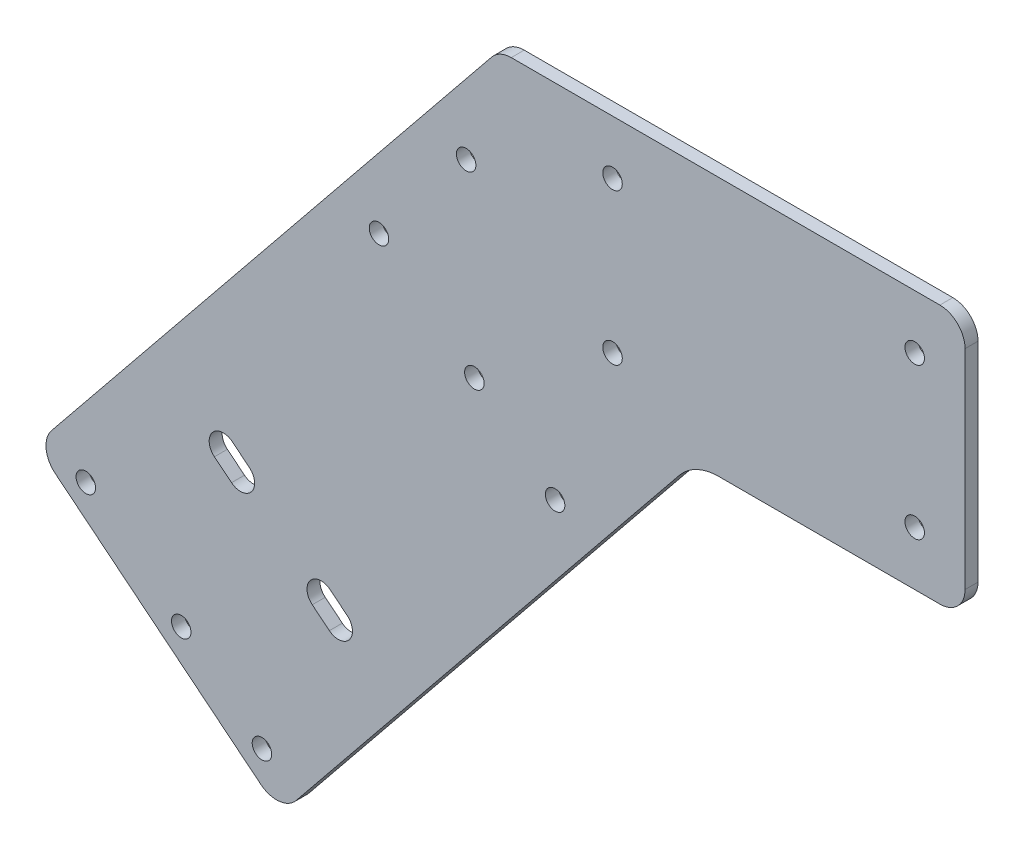
ISO-10303-21;
HEADER;
FILE_DESCRIPTION(('STEP AP214'),'2;1');
FILE_NAME('part.step','',(''),(''),'','','');
FILE_SCHEMA(('AUTOMOTIVE_DESIGN { 1 0 10303 214 1 1 1 1 }'));
ENDSEC;
DATA;
#1=APPLICATION_CONTEXT('core data for automotive mechanical design processes');
#2=APPLICATION_PROTOCOL_DEFINITION('international standard','automotive_design',2000,#1);
#3=PRODUCT_CONTEXT('',#1,'mechanical');
#4=PRODUCT('Part','Part','',(#3));
#5=PRODUCT_RELATED_PRODUCT_CATEGORY('part','',(#4));
#6=PRODUCT_DEFINITION_FORMATION('','',#4);
#7=PRODUCT_DEFINITION_CONTEXT('part definition',#1,'design');
#8=PRODUCT_DEFINITION('design','',#6,#7);
#9=PRODUCT_DEFINITION_SHAPE('','',#8);
#10=(LENGTH_UNIT() NAMED_UNIT(*) SI_UNIT(.MILLI.,.METRE.));
#11=(NAMED_UNIT(*) PLANE_ANGLE_UNIT() SI_UNIT($,.RADIAN.));
#12=(NAMED_UNIT(*) SI_UNIT($,.STERADIAN.) SOLID_ANGLE_UNIT());
#13=UNCERTAINTY_MEASURE_WITH_UNIT(LENGTH_MEASURE(1.E-05),#10,'distance_accuracy_value','');
#14=(GEOMETRIC_REPRESENTATION_CONTEXT(3) GLOBAL_UNCERTAINTY_ASSIGNED_CONTEXT((#13)) GLOBAL_UNIT_ASSIGNED_CONTEXT((#10,
#11,#12)) REPRESENTATION_CONTEXT('',''));
#15=CARTESIAN_POINT('',(0.,0.,0.));
#16=DIRECTION('',(0.,0.,1.));
#17=DIRECTION('',(1.,0.,0.));
#18=AXIS2_PLACEMENT_3D('',#15,#16,#17);
#19=CARTESIAN_POINT('',(0.,0.,0.));
#20=DIRECTION('',(0.,0.,-1.));
#21=DIRECTION('',(-1.,0.,0.));
#22=AXIS2_PLACEMENT_3D('',#19,#20,#21);
#23=PLANE('',#22);
#24=CARTESIAN_POINT('',(-40.5850569542009,-112.654894730681,0.));
#25=DIRECTION('',(0.,0.,1.));
#26=DIRECTION('',(1.,0.,0.));
#27=AXIS2_PLACEMENT_3D('',#24,#25,#26);
#28=CIRCLE('',#27,3.57124);
#29=CARTESIAN_POINT('',(-42.8325111075338,-115.430269474074,0.));
#30=VERTEX_POINT('',#29);
#31=CARTESIAN_POINT('',(-38.3376028008681,-109.879519987287,0.));
#32=VERTEX_POINT('',#31);
#33=EDGE_CURVE('E333',#30,#32,#28,.T.);
#34=ORIENTED_EDGE('',*,*,#33,.F.);
#35=DIRECTION('',(0.777145961456969,-0.62932039104984,0.));
#36=VECTOR('',#35,1.);
#37=CARTESIAN_POINT('',(-47.1515153312501,-111.932808814407,0.));
#38=LINE('',#37,#36);
#39=CARTESIAN_POINT('',(-47.1515153312501,-111.932808814407,0.));
#40=VERTEX_POINT('',#39);
#41=EDGE_CURVE('E346',#40,#30,#38,.T.);
#42=ORIENTED_EDGE('',*,*,#41,.F.);
#43=CARTESIAN_POINT('',(-44.9040611779172,-109.157434071013,0.));
#44=DIRECTION('',(0.,0.,1.));
#45=DIRECTION('',(1.,0.,0.));
#46=AXIS2_PLACEMENT_3D('',#43,#44,#45);
#47=CIRCLE('',#46,3.57124);
#48=CARTESIAN_POINT('',(-42.6566070245844,-106.38205932762,0.));
#49=VERTEX_POINT('',#48);
#50=EDGE_CURVE('E345',#49,#40,#47,.T.);
#51=ORIENTED_EDGE('',*,*,#50,.F.);
#52=DIRECTION('',(0.777145961456969,-0.62932039104984,0.));
#53=VECTOR('',#52,1.);
#54=CARTESIAN_POINT('',(-42.6566070245844,-106.38205932762,0.));
#55=LINE('',#54,#53);
#56=EDGE_CURVE('E326',#49,#32,#55,.T.);
#57=ORIENTED_EDGE('',*,*,#56,.T.);
#58=EDGE_LOOP('',(#34,#42,#51,#57));
#59=FACE_BOUND('',#58,.T.);
#60=CARTESIAN_POINT('',(104.775,-19.05,0.));
#61=DIRECTION('',(0.,0.,1.));
#62=DIRECTION('',(1.,0.,0.));
#63=AXIS2_PLACEMENT_3D('',#60,#61,#62);
#64=CIRCLE('',#63,2.45744999999999);
#65=CARTESIAN_POINT('',(107.23245,-19.05,0.));
#66=VERTEX_POINT('',#65);
#67=EDGE_CURVE('E413',#66,#66,#64,.T.);
#68=ORIENTED_EDGE('',*,*,#67,.F.);
#69=EDGE_LOOP('',(#68));
#70=FACE_BOUND('',#69,.T.);
#71=CARTESIAN_POINT('',(104.775,19.05,0.));
#72=DIRECTION('',(0.,0.,1.));
#73=DIRECTION('',(1.,0.,0.));
#74=AXIS2_PLACEMENT_3D('',#71,#72,#73);
#75=CIRCLE('',#74,2.45744999999999);
#76=CARTESIAN_POINT('',(107.23245,19.05,0.));
#77=VERTEX_POINT('',#76);
#78=EDGE_CURVE('E407',#77,#77,#75,.T.);
#79=ORIENTED_EDGE('',*,*,#78,.F.);
#80=EDGE_LOOP('',(#79));
#81=FACE_BOUND('',#80,.T.);
#82=CARTESIAN_POINT('',(28.575,-19.05,0.));
#83=DIRECTION('',(0.,0.,1.));
#84=DIRECTION('',(1.,0.,0.));
#85=AXIS2_PLACEMENT_3D('',#82,#83,#84);
#86=CIRCLE('',#85,2.45744999999999);
#87=CARTESIAN_POINT('',(31.03245,-19.05,0.));
#88=VERTEX_POINT('',#87);
#89=EDGE_CURVE('E401',#88,#88,#86,.T.);
#90=ORIENTED_EDGE('',*,*,#89,.F.);
#91=EDGE_LOOP('',(#90));
#92=FACE_BOUND('',#91,.T.);
#93=CARTESIAN_POINT('',(28.575,19.05,0.));
#94=DIRECTION('',(0.,0.,1.));
#95=DIRECTION('',(1.,0.,0.));
#96=AXIS2_PLACEMENT_3D('',#93,#94,#95);
#97=CIRCLE('',#96,2.45744999999999);
#98=CARTESIAN_POINT('',(31.03245,19.05,0.));
#99=VERTEX_POINT('',#98);
#100=EDGE_CURVE('E393',#99,#99,#97,.T.);
#101=ORIENTED_EDGE('',*,*,#100,.F.);
#102=EDGE_LOOP('',(#101));
#103=FACE_BOUND('',#102,.T.);
#104=DIRECTION('',(0.629320391049841,0.777145961456968,0.));
#105=VECTOR('',#104,1.);
#106=CARTESIAN_POINT('',(49.2446056522016,-32.65805,0.));
#107=LINE('',#106,#105);
#108=CARTESIAN_POINT('',(-51.2062509588066,-156.704527200443,0.));
#109=VERTEX_POINT('',#108);
#110=CARTESIAN_POINT('',(45.4324412069647,-37.365681033667,0.));
#111=VERTEX_POINT('',#110);
#112=EDGE_CURVE('E379',#109,#111,#107,.T.);
#113=ORIENTED_EDGE('',*,*,#112,.T.);
#114=CARTESIAN_POINT('',(55.3021949174682,-45.35805,0.));
#115=DIRECTION('',(0.,0.,-1.));
#116=DIRECTION('',(-1.,0.,0.));
#117=AXIS2_PLACEMENT_3D('',#114,#115,#116);
#118=CIRCLE('',#117,12.7);
#119=CARTESIAN_POINT('',(55.3021949174682,-32.65805,0.));
#120=VERTEX_POINT('',#119);
#121=EDGE_CURVE('E194',#111,#120,#118,.T.);
#122=ORIENTED_EDGE('',*,*,#121,.T.);
#123=DIRECTION('',(1.,0.,0.));
#124=VECTOR('',#123,1.);
#125=CARTESIAN_POINT('',(0.,-32.65805,0.));
#126=LINE('',#125,#124);
#127=CARTESIAN_POINT('',(111.125,-32.65805,0.));
#128=VERTEX_POINT('',#127);
#129=EDGE_CURVE('E419',#120,#128,#126,.T.);
#130=ORIENTED_EDGE('',*,*,#129,.T.);
#131=CARTESIAN_POINT('',(111.125,-26.30805,0.));
#132=DIRECTION('',(0.,0.,-1.));
#133=DIRECTION('',(-1.,0.,0.));
#134=AXIS2_PLACEMENT_3D('',#131,#132,#133);
#135=CIRCLE('',#134,6.35);
#136=CARTESIAN_POINT('',(117.475,-26.30805,0.));
#137=VERTEX_POINT('',#136);
#138=EDGE_CURVE('E463',#128,#137,#135,.F.);
#139=ORIENTED_EDGE('',*,*,#138,.T.);
#140=DIRECTION('',(0.,1.,0.));
#141=VECTOR('',#140,1.);
#142=CARTESIAN_POINT('',(117.475,-32.65805,0.));
#143=LINE('',#142,#141);
#144=CARTESIAN_POINT('',(117.475,26.30805,0.));
#145=VERTEX_POINT('',#144);
#146=EDGE_CURVE('E431',#137,#145,#143,.T.);
#147=ORIENTED_EDGE('',*,*,#146,.T.);
#148=CARTESIAN_POINT('',(111.125,26.30805,0.));
#149=DIRECTION('',(0.,0.,-1.));
#150=DIRECTION('',(-1.,0.,0.));
#151=AXIS2_PLACEMENT_3D('',#148,#149,#150);
#152=CIRCLE('',#151,6.35);
#153=CARTESIAN_POINT('',(111.125,32.65805,0.));
#154=VERTEX_POINT('',#153);
#155=EDGE_CURVE('E461',#145,#154,#152,.F.);
#156=ORIENTED_EDGE('',*,*,#155,.T.);
#157=DIRECTION('',(-1.,0.,0.));
#158=VECTOR('',#157,1.);
#159=CARTESIAN_POINT('',(0.,32.65805,0.));
#160=LINE('',#159,#158);
#161=CARTESIAN_POINT('',(3.02879463263332,32.65805,0.));
#162=VERTEX_POINT('',#161);
#163=EDGE_CURVE('E423',#154,#162,#160,.T.);
#164=ORIENTED_EDGE('',*,*,#163,.T.);
#165=CARTESIAN_POINT('',(3.02879463263332,26.30805,0.));
#166=DIRECTION('',(0.,0.,-1.));
#167=DIRECTION('',(-1.,0.,0.));
#168=AXIS2_PLACEMENT_3D('',#165,#166,#167);
#169=CIRCLE('',#168,6.35);
#170=CARTESIAN_POINT('',(-1.90608222261843,30.3042344831665,0.));
#171=VERTEX_POINT('',#170);
#172=EDGE_CURVE('E459',#162,#171,#169,.F.);
#173=ORIENTED_EDGE('',*,*,#172,.T.);
#174=DIRECTION('',(-0.629320391049841,-0.777145961456968,0.));
#175=VECTOR('',#174,1.);
#176=CARTESIAN_POINT('',(0.,32.65805,0.));
#177=LINE('',#176,#175);
#178=CARTESIAN_POINT('',(-112.892211649453,-106.752221160862,0.));
#179=VERTEX_POINT('',#178);
#180=EDGE_CURVE('E378',#171,#179,#177,.T.);
#181=ORIENTED_EDGE('',*,*,#180,.T.);
#182=CARTESIAN_POINT('',(-107.957334794202,-110.748405644028,0.));
#183=DIRECTION('',(0.,0.,-1.));
#184=DIRECTION('',(-1.,0.,0.));
#185=AXIS2_PLACEMENT_3D('',#182,#183,#184);
#186=CIRCLE('',#185,6.35);
#187=CARTESIAN_POINT('',(-111.953519277368,-115.68328249928,0.));
#188=VERTEX_POINT('',#187);
#189=EDGE_CURVE('E457',#179,#188,#186,.F.);
#190=ORIENTED_EDGE('',*,*,#189,.T.);
#191=DIRECTION('',(0.777145961456967,-0.629320391049841,0.));
#192=VECTOR('',#191,1.);
#193=CARTESIAN_POINT('',(-55.2024354419731,-161.639404055695,0.));
#194=LINE('',#193,#192);
#195=CARTESIAN_POINT('',(-60.1373122972249,-157.643219572528,0.));
#196=VERTEX_POINT('',#195);
#197=EDGE_CURVE('E382',#188,#196,#194,.T.);
#198=ORIENTED_EDGE('',*,*,#197,.T.);
#199=CARTESIAN_POINT('',(-56.1411278140584,-152.708342717276,0.));
#200=DIRECTION('',(0.,0.,-1.));
#201=DIRECTION('',(-1.,0.,0.));
#202=AXIS2_PLACEMENT_3D('',#199,#200,#201);
#203=CIRCLE('',#202,6.35);
#204=EDGE_CURVE('E455',#196,#109,#203,.F.);
#205=ORIENTED_EDGE('',*,*,#204,.T.);
#206=EDGE_LOOP('',(#113,#122,#130,#139,#147,#156,#164,#173,#181,#190,#198,#205));
#207=FACE_BOUND('',#206,.T.);
#208=DIRECTION('',(0.777145961456968,-0.629320391049841,0.));
#209=VECTOR('',#208,1.);
#210=CARTESIAN_POINT('',(-71.8258996075088,-91.9518863985744,0.));
#211=LINE('',#210,#209);
#212=CARTESIAN_POINT('',(-71.8258996075088,-91.9518863985744,0.));
#213=VERTEX_POINT('',#212);
#214=CARTESIAN_POINT('',(-67.5068953837925,-95.4493470582417,0.));
#215=VERTEX_POINT('',#214);
#216=EDGE_CURVE('E357',#213,#215,#211,.T.);
#217=ORIENTED_EDGE('',*,*,#216,.F.);
#218=CARTESIAN_POINT('',(-69.5784454541759,-89.1765116551808,0.));
#219=DIRECTION('',(0.,0.,1.));
#220=DIRECTION('',(1.,0.,0.));
#221=AXIS2_PLACEMENT_3D('',#218,#219,#220);
#222=CIRCLE('',#221,3.57124);
#223=CARTESIAN_POINT('',(-67.3309913008432,-86.4011369117872,0.));
#224=VERTEX_POINT('',#223);
#225=EDGE_CURVE('E362',#224,#213,#222,.T.);
#226=ORIENTED_EDGE('',*,*,#225,.F.);
#227=DIRECTION('',(0.777145961456968,-0.629320391049841,0.));
#228=VECTOR('',#227,1.);
#229=CARTESIAN_POINT('',(-67.3309913008432,-86.4011369117872,0.));
#230=LINE('',#229,#228);
#231=CARTESIAN_POINT('',(-63.0119870771268,-89.8985975714545,0.));
#232=VERTEX_POINT('',#231);
#233=EDGE_CURVE('E359',#224,#232,#230,.T.);
#234=ORIENTED_EDGE('',*,*,#233,.T.);
#235=CARTESIAN_POINT('',(-65.2594412304596,-92.6739723148481,0.));
#236=DIRECTION('',(0.,0.,1.));
#237=DIRECTION('',(1.,0.,0.));
#238=AXIS2_PLACEMENT_3D('',#235,#236,#237);
#239=CIRCLE('',#238,3.57124);
#240=EDGE_CURVE('E370',#215,#232,#239,.T.);
#241=ORIENTED_EDGE('',*,*,#240,.F.);
#242=EDGE_LOOP('',(#217,#226,#234,#241));
#243=FACE_BOUND('',#242,.T.);
#244=CARTESIAN_POINT('',(-8.34774955676706,4.69150051963871,0.));
#245=DIRECTION('',(0.,0.,1.));
#246=DIRECTION('',(1.,0.,0.));
#247=AXIS2_PLACEMENT_3D('',#244,#245,#246);
#248=CIRCLE('',#247,2.45744999999999);
#249=CARTESIAN_POINT('',(-5.89029955676707,4.69150051963871,0.));
#250=VERTEX_POINT('',#249);
#251=EDGE_CURVE('E926',#250,#250,#248,.T.);
#252=ORIENTED_EDGE('',*,*,#251,.F.);
#253=EDGE_LOOP('',(#252));
#254=FACE_BOUND('',#253,.T.);
#255=CARTESIAN_POINT('',(-80.1986524834106,-133.22694336184,0.));
#256=DIRECTION('',(0.,0.,1.));
#257=DIRECTION('',(1.,0.,0.));
#258=AXIS2_PLACEMENT_3D('',#255,#256,#257);
#259=CIRCLE('',#258,2.45744999999999);
#260=CARTESIAN_POINT('',(-77.7412024834106,-133.22694336184,0.));
#261=VERTEX_POINT('',#260);
#262=EDGE_CURVE('E920',#261,#261,#259,.T.);
#263=ORIENTED_EDGE('',*,*,#262,.F.);
#264=EDGE_LOOP('',(#263));
#265=FACE_BOUND('',#264,.T.);
#266=CARTESIAN_POINT('',(-6.26923954483048,-41.9317215396825,0.));
#267=DIRECTION('',(0.,0.,1.));
#268=DIRECTION('',(1.,0.,0.));
#269=AXIS2_PLACEMENT_3D('',#266,#267,#268);
#270=CIRCLE('',#269,2.45744999999999);
#271=CARTESIAN_POINT('',(-3.81178954483049,-41.9317215396825,0.));
#272=VERTEX_POINT('',#271);
#273=EDGE_CURVE('E914',#272,#272,#270,.T.);
#274=ORIENTED_EDGE('',*,*,#273,.F.);
#275=EDGE_LOOP('',(#274));
#276=FACE_BOUND('',#275,.T.);
#277=CARTESIAN_POINT('',(-59.8422854554971,-149.711204354902,0.));
#278=DIRECTION('',(0.,0.,1.));
#279=DIRECTION('',(1.,0.,0.));
#280=AXIS2_PLACEMENT_3D('',#277,#278,#279);
#281=CIRCLE('',#280,2.45744999999999);
#282=CARTESIAN_POINT('',(-57.3848354554972,-149.711204354902,0.));
#283=VERTEX_POINT('',#282);
#284=EDGE_CURVE('E908',#283,#283,#281,.T.);
#285=ORIENTED_EDGE('',*,*,#284,.F.);
#286=EDGE_LOOP('',(#285));
#287=FACE_BOUND('',#286,.T.);
#288=CARTESIAN_POINT('',(14.087127483083,-58.4159825327443,0.));
#289=DIRECTION('',(0.,0.,1.));
#290=DIRECTION('',(1.,0.,0.));
#291=AXIS2_PLACEMENT_3D('',#288,#289,#290);
#292=CIRCLE('',#291,2.45744999999999);
#293=CARTESIAN_POINT('',(16.544577483083,-58.4159825327443,0.));
#294=VERTEX_POINT('',#293);
#295=EDGE_CURVE('E902',#294,#294,#292,.T.);
#296=ORIENTED_EDGE('',*,*,#295,.F.);
#297=EDGE_LOOP('',(#296));
#298=FACE_BOUND('',#297,.T.);
#299=CARTESIAN_POINT('',(-104.256177152763,-113.745544006403,0.));
#300=DIRECTION('',(0.,0.,1.));
#301=DIRECTION('',(1.,0.,0.));
#302=AXIS2_PLACEMENT_3D('',#299,#300,#301);
#303=CIRCLE('',#302,2.45744999999999);
#304=CARTESIAN_POINT('',(-101.798727152763,-113.745544006403,0.));
#305=VERTEX_POINT('',#304);
#306=EDGE_CURVE('E893',#305,#305,#303,.T.);
#307=ORIENTED_EDGE('',*,*,#306,.F.);
#308=EDGE_LOOP('',(#307));
#309=FACE_BOUND('',#308,.T.);
#310=CARTESIAN_POINT('',(-30.3267642141827,-22.4503221842459,0.));
#311=DIRECTION('',(0.,0.,1.));
#312=DIRECTION('',(1.,0.,0.));
#313=AXIS2_PLACEMENT_3D('',#310,#311,#312);
#314=CIRCLE('',#313,2.45744999999999);
#315=CARTESIAN_POINT('',(-27.8693142141828,-22.4503221842459,0.));
#316=VERTEX_POINT('',#315);
#317=EDGE_CURVE('E889',#316,#316,#314,.T.);
#318=ORIENTED_EDGE('',*,*,#317,.F.);
#319=EDGE_LOOP('',(#318));
#320=FACE_BOUND('',#319,.T.);
#321=ADVANCED_FACE('F186',(#59,#70,#81,#92,#103,#207,#243,#254,#265,#276,#287,#298,#309,#320),
#23,.F.);
#322=CARTESIAN_POINT('',(0.,32.65805,-3.2639));
#323=DIRECTION('',(0.,1.,0.));
#324=DIRECTION('',(0.,0.,1.));
#325=AXIS2_PLACEMENT_3D('',#322,#323,#324);
#326=PLANE('',#325);
#327=ORIENTED_EDGE('',*,*,#163,.F.);
#328=DIRECTION('',(0.,0.,1.));
#329=VECTOR('',#328,1.);
#330=CARTESIAN_POINT('',(111.125,32.65805,-3.2639));
#331=LINE('',#330,#329);
#332=CARTESIAN_POINT('',(111.125,32.65805,-3.2639));
#333=VERTEX_POINT('',#332);
#334=EDGE_CURVE('E484',#154,#333,#331,.F.);
#335=ORIENTED_EDGE('',*,*,#334,.T.);
#336=DIRECTION('',(-1.,0.,0.));
#337=VECTOR('',#336,1.);
#338=CARTESIAN_POINT('',(0.,32.65805,-3.2639));
#339=LINE('',#338,#337);
#340=CARTESIAN_POINT('',(3.02879463263332,32.65805,-3.2639));
#341=VERTEX_POINT('',#340);
#342=EDGE_CURVE('E426',#333,#341,#339,.T.);
#343=ORIENTED_EDGE('',*,*,#342,.T.);
#344=DIRECTION('',(0.,0.,1.));
#345=VECTOR('',#344,1.);
#346=CARTESIAN_POINT('',(3.02879463263332,32.65805,-3.2639));
#347=LINE('',#346,#345);
#348=EDGE_CURVE('E481',#341,#162,#347,.T.);
#349=ORIENTED_EDGE('',*,*,#348,.T.);
#350=EDGE_LOOP('',(#327,#335,#343,#349));
#351=FACE_BOUND('',#350,.T.);
#352=ADVANCED_FACE('F538',(#351),#326,.T.);
#353=CARTESIAN_POINT('',(117.475,-32.65805,-3.2639));
#354=DIRECTION('',(1.,0.,0.));
#355=DIRECTION('',(0.,1.,0.));
#356=AXIS2_PLACEMENT_3D('',#353,#354,#355);
#357=PLANE('',#356);
#358=ORIENTED_EDGE('',*,*,#146,.F.);
#359=DIRECTION('',(0.,0.,1.));
#360=VECTOR('',#359,1.);
#361=CARTESIAN_POINT('',(117.475,-26.30805,-3.2639));
#362=LINE('',#361,#360);
#363=CARTESIAN_POINT('',(117.475,-26.30805,-3.2639));
#364=VERTEX_POINT('',#363);
#365=EDGE_CURVE('E468',#137,#364,#362,.F.);
#366=ORIENTED_EDGE('',*,*,#365,.T.);
#367=DIRECTION('',(0.,1.,0.));
#368=VECTOR('',#367,1.);
#369=CARTESIAN_POINT('',(117.475,-32.65805,-3.2639));
#370=LINE('',#369,#368);
#371=CARTESIAN_POINT('',(117.475,26.30805,-3.2639));
#372=VERTEX_POINT('',#371);
#373=EDGE_CURVE('E422',#364,#372,#370,.T.);
#374=ORIENTED_EDGE('',*,*,#373,.T.);
#375=DIRECTION('',(0.,0.,1.));
#376=VECTOR('',#375,1.);
#377=CARTESIAN_POINT('',(117.475,26.30805,-3.2639));
#378=LINE('',#377,#376);
#379=EDGE_CURVE('E465',#372,#145,#378,.T.);
#380=ORIENTED_EDGE('',*,*,#379,.T.);
#381=EDGE_LOOP('',(#358,#366,#374,#380));
#382=FACE_BOUND('',#381,.T.);
#383=ADVANCED_FACE('F547',(#382),#357,.T.);
#384=CARTESIAN_POINT('',(0.,-32.65805,-3.2639));
#385=DIRECTION('',(0.,-1.,0.));
#386=DIRECTION('',(1.,0.,0.));
#387=AXIS2_PLACEMENT_3D('',#384,#385,#386);
#388=PLANE('',#387);
#389=ORIENTED_EDGE('',*,*,#129,.F.);
#390=DIRECTION('',(0.,0.,1.));
#391=VECTOR('',#390,1.);
#392=CARTESIAN_POINT('',(55.3021949174682,-32.65805,-3.26389999999999));
#393=LINE('',#392,#391);
#394=CARTESIAN_POINT('',(55.3021949174682,-32.65805,-3.2639));
#395=VERTEX_POINT('',#394);
#396=EDGE_CURVE('E207',#120,#395,#393,.F.);
#397=ORIENTED_EDGE('',*,*,#396,.T.);
#398=DIRECTION('',(1.,0.,0.));
#399=VECTOR('',#398,1.);
#400=CARTESIAN_POINT('',(0.,-32.65805,-3.2639));
#401=LINE('',#400,#399);
#402=CARTESIAN_POINT('',(111.125,-32.65805,-3.2639));
#403=VERTEX_POINT('',#402);
#404=EDGE_CURVE('E420',#395,#403,#401,.T.);
#405=ORIENTED_EDGE('',*,*,#404,.T.);
#406=DIRECTION('',(0.,0.,1.));
#407=VECTOR('',#406,1.);
#408=CARTESIAN_POINT('',(111.125,-32.65805,-3.2639));
#409=LINE('',#408,#407);
#410=EDGE_CURVE('E452',#403,#128,#409,.T.);
#411=ORIENTED_EDGE('',*,*,#410,.T.);
#412=EDGE_LOOP('',(#389,#397,#405,#411));
#413=FACE_BOUND('',#412,.T.);
#414=ADVANCED_FACE('F554',(#413),#388,.T.);
#415=CARTESIAN_POINT('',(0.,0.,-3.2639));
#416=DIRECTION('',(0.,0.,-1.));
#417=DIRECTION('',(-1.,0.,0.));
#418=AXIS2_PLACEMENT_3D('',#415,#416,#417);
#419=PLANE('',#418);
#420=CARTESIAN_POINT('',(-30.3267642141827,-22.4503221842459,-3.2639));
#421=DIRECTION('',(0.,0.,-1.));
#422=DIRECTION('',(-1.,0.,0.));
#423=AXIS2_PLACEMENT_3D('',#420,#421,#422);
#424=CIRCLE('',#423,2.45744999999999);
#425=CARTESIAN_POINT('',(-32.7842142141827,-22.4503221842459,-3.2639));
#426=VERTEX_POINT('',#425);
#427=EDGE_CURVE('E892',#426,#426,#424,.T.);
#428=ORIENTED_EDGE('',*,*,#427,.F.);
#429=EDGE_LOOP('',(#428));
#430=FACE_BOUND('',#429,.T.);
#431=CARTESIAN_POINT('',(-104.256177152763,-113.745544006403,-3.2639));
#432=DIRECTION('',(0.,0.,-1.));
#433=DIRECTION('',(-1.,0.,0.));
#434=AXIS2_PLACEMENT_3D('',#431,#432,#433);
#435=CIRCLE('',#434,2.45744999999999);
#436=CARTESIAN_POINT('',(-106.713627152763,-113.745544006403,-3.2639));
#437=VERTEX_POINT('',#436);
#438=EDGE_CURVE('E896',#437,#437,#435,.T.);
#439=ORIENTED_EDGE('',*,*,#438,.F.);
#440=EDGE_LOOP('',(#439));
#441=FACE_BOUND('',#440,.T.);
#442=CARTESIAN_POINT('',(14.087127483083,-58.4159825327443,-3.2639));
#443=DIRECTION('',(0.,0.,-1.));
#444=DIRECTION('',(-1.,0.,0.));
#445=AXIS2_PLACEMENT_3D('',#442,#443,#444);
#446=CIRCLE('',#445,2.45744999999999);
#447=CARTESIAN_POINT('',(11.629677483083,-58.4159825327443,-3.2639));
#448=VERTEX_POINT('',#447);
#449=EDGE_CURVE('E905',#448,#448,#446,.T.);
#450=ORIENTED_EDGE('',*,*,#449,.F.);
#451=EDGE_LOOP('',(#450));
#452=FACE_BOUND('',#451,.T.);
#453=CARTESIAN_POINT('',(-59.8422854554971,-149.711204354902,-3.2639));
#454=DIRECTION('',(0.,0.,-1.));
#455=DIRECTION('',(-1.,0.,0.));
#456=AXIS2_PLACEMENT_3D('',#453,#454,#455);
#457=CIRCLE('',#456,2.45744999999999);
#458=CARTESIAN_POINT('',(-62.2997354554971,-149.711204354902,-3.2639));
#459=VERTEX_POINT('',#458);
#460=EDGE_CURVE('E911',#459,#459,#457,.T.);
#461=ORIENTED_EDGE('',*,*,#460,.F.);
#462=EDGE_LOOP('',(#461));
#463=FACE_BOUND('',#462,.T.);
#464=CARTESIAN_POINT('',(-6.26923954483048,-41.9317215396825,-3.2639));
#465=DIRECTION('',(0.,0.,-1.));
#466=DIRECTION('',(-1.,0.,0.));
#467=AXIS2_PLACEMENT_3D('',#464,#465,#466);
#468=CIRCLE('',#467,2.45744999999999);
#469=CARTESIAN_POINT('',(-8.72668954483047,-41.9317215396825,-3.2639));
#470=VERTEX_POINT('',#469);
#471=EDGE_CURVE('E917',#470,#470,#468,.T.);
#472=ORIENTED_EDGE('',*,*,#471,.F.);
#473=EDGE_LOOP('',(#472));
#474=FACE_BOUND('',#473,.T.);
#475=CARTESIAN_POINT('',(-80.1986524834106,-133.22694336184,-3.2639));
#476=DIRECTION('',(0.,0.,-1.));
#477=DIRECTION('',(-1.,0.,0.));
#478=AXIS2_PLACEMENT_3D('',#475,#476,#477);
#479=CIRCLE('',#478,2.45744999999999);
#480=CARTESIAN_POINT('',(-82.6561024834106,-133.22694336184,-3.2639));
#481=VERTEX_POINT('',#480);
#482=EDGE_CURVE('E923',#481,#481,#479,.T.);
#483=ORIENTED_EDGE('',*,*,#482,.F.);
#484=EDGE_LOOP('',(#483));
#485=FACE_BOUND('',#484,.T.);
#486=CARTESIAN_POINT('',(-8.34774955676706,4.69150051963871,-3.2639));
#487=DIRECTION('',(0.,0.,-1.));
#488=DIRECTION('',(-1.,0.,0.));
#489=AXIS2_PLACEMENT_3D('',#486,#487,#488);
#490=CIRCLE('',#489,2.45744999999999);
#491=CARTESIAN_POINT('',(-10.8051995567671,4.69150051963871,-3.2639));
#492=VERTEX_POINT('',#491);
#493=EDGE_CURVE('E350',#492,#492,#490,.T.);
#494=ORIENTED_EDGE('',*,*,#493,.F.);
#495=EDGE_LOOP('',(#494));
#496=FACE_BOUND('',#495,.T.);
#497=DIRECTION('',(0.777145961456969,-0.62932039104984,0.));
#498=VECTOR('',#497,1.);
#499=CARTESIAN_POINT('',(-68.9225779129937,-85.1122954858208,-3.2639));
#500=LINE('',#499,#498);
#501=CARTESIAN_POINT('',(-42.6566070245844,-106.38205932762,-3.2639));
#502=VERTEX_POINT('',#501);
#503=CARTESIAN_POINT('',(-38.3376028008681,-109.879519987287,-3.2639));
#504=VERTEX_POINT('',#503);
#505=EDGE_CURVE('E329',#502,#504,#500,.T.);
#506=ORIENTED_EDGE('',*,*,#505,.F.);
#507=CARTESIAN_POINT('',(-44.9040611779172,-109.157434071013,-3.2639));
#508=DIRECTION('',(0.,0.,-1.));
#509=DIRECTION('',(-1.,0.,0.));
#510=AXIS2_PLACEMENT_3D('',#507,#508,#509);
#511=CIRCLE('',#510,3.57124);
#512=CARTESIAN_POINT('',(-47.1515153312501,-111.932808814407,-3.2639));
#513=VERTEX_POINT('',#512);
#514=EDGE_CURVE('E447',#513,#502,#511,.T.);
#515=ORIENTED_EDGE('',*,*,#514,.F.);
#516=DIRECTION('',(-0.777145961456969,0.62932039104984,0.));
#517=VECTOR('',#516,1.);
#518=CARTESIAN_POINT('',(-73.4174862196593,-90.663044972608,-3.2639));
#519=LINE('',#518,#517);
#520=CARTESIAN_POINT('',(-42.8325111075338,-115.430269474074,-3.2639));
#521=VERTEX_POINT('',#520);
#522=EDGE_CURVE('E444',#521,#513,#519,.T.);
#523=ORIENTED_EDGE('',*,*,#522,.F.);
#524=CARTESIAN_POINT('',(-40.5850569542009,-112.654894730681,-3.2639));
#525=DIRECTION('',(0.,0.,-1.));
#526=DIRECTION('',(-1.,0.,0.));
#527=AXIS2_PLACEMENT_3D('',#524,#525,#526);
#528=CIRCLE('',#527,3.57124);
#529=EDGE_CURVE('E449',#504,#521,#528,.T.);
#530=ORIENTED_EDGE('',*,*,#529,.F.);
#531=EDGE_LOOP('',(#506,#515,#523,#530));
#532=FACE_BOUND('',#531,.T.);
#533=DIRECTION('',(0.777145961456968,-0.629320391049841,0.));
#534=VECTOR('',#533,1.);
#535=CARTESIAN_POINT('',(-68.9225779129937,-85.1122954858207,-3.2639));
#536=LINE('',#535,#534);
#537=CARTESIAN_POINT('',(-67.330991300843,-86.4011369117872,-3.2639));
#538=VERTEX_POINT('',#537);
#539=CARTESIAN_POINT('',(-63.0119870771268,-89.8985975714545,-3.2639));
#540=VERTEX_POINT('',#539);
#541=EDGE_CURVE('E441',#538,#540,#536,.T.);
#542=ORIENTED_EDGE('',*,*,#541,.F.);
#543=CARTESIAN_POINT('',(-69.5784454541759,-89.1765116551808,-3.2639));
#544=DIRECTION('',(0.,0.,-1.));
#545=DIRECTION('',(-1.,0.,0.));
#546=AXIS2_PLACEMENT_3D('',#543,#544,#545);
#547=CIRCLE('',#546,3.57124);
#548=CARTESIAN_POINT('',(-71.8258996075087,-91.9518863985744,-3.2639));
#549=VERTEX_POINT('',#548);
#550=EDGE_CURVE('E437',#549,#538,#547,.T.);
#551=ORIENTED_EDGE('',*,*,#550,.F.);
#552=DIRECTION('',(-0.777145961456968,0.629320391049841,0.));
#553=VECTOR('',#552,1.);
#554=CARTESIAN_POINT('',(-73.4174862196594,-90.6630449726078,-3.2639));
#555=LINE('',#554,#553);
#556=CARTESIAN_POINT('',(-67.5068953837925,-95.4493470582417,-3.2639));
#557=VERTEX_POINT('',#556);
#558=EDGE_CURVE('E429',#557,#549,#555,.T.);
#559=ORIENTED_EDGE('',*,*,#558,.F.);
#560=CARTESIAN_POINT('',(-65.2594412304596,-92.6739723148481,-3.2639));
#561=DIRECTION('',(0.,0.,-1.));
#562=DIRECTION('',(-1.,0.,0.));
#563=AXIS2_PLACEMENT_3D('',#560,#561,#562);
#564=CIRCLE('',#563,3.57124);
#565=EDGE_CURVE('E439',#540,#557,#564,.T.);
#566=ORIENTED_EDGE('',*,*,#565,.F.);
#567=EDGE_LOOP('',(#542,#551,#559,#566));
#568=FACE_BOUND('',#567,.T.);
#569=ORIENTED_EDGE('',*,*,#373,.F.);
#570=CARTESIAN_POINT('',(111.125,-26.30805,-3.2639));
#571=DIRECTION('',(0.,0.,-1.));
#572=DIRECTION('',(-1.,0.,0.));
#573=AXIS2_PLACEMENT_3D('',#570,#571,#572);
#574=CIRCLE('',#573,6.35);
#575=EDGE_CURVE('E478',#364,#403,#574,.T.);
#576=ORIENTED_EDGE('',*,*,#575,.T.);
#577=ORIENTED_EDGE('',*,*,#404,.F.);
#578=CARTESIAN_POINT('',(55.3021949174682,-45.35805,-3.26389999999999));
#579=DIRECTION('',(0.,0.,-1.));
#580=DIRECTION('',(-1.,0.,0.));
#581=AXIS2_PLACEMENT_3D('',#578,#579,#580);
#582=CIRCLE('',#581,12.7);
#583=CARTESIAN_POINT('',(45.4324412069647,-37.365681033667,-3.26389999999999));
#584=VERTEX_POINT('',#583);
#585=EDGE_CURVE('E13',#395,#584,#582,.F.);
#586=ORIENTED_EDGE('',*,*,#585,.T.);
#587=DIRECTION('',(0.629320391049841,0.777145961456968,0.));
#588=VECTOR('',#587,1.);
#589=CARTESIAN_POINT('',(49.2446056522016,-32.65805,-3.26389999999999));
#590=LINE('',#589,#588);
#591=CARTESIAN_POINT('',(-51.2062509588066,-156.704527200443,-3.26389999999999));
#592=VERTEX_POINT('',#591);
#593=EDGE_CURVE('E390',#592,#584,#590,.T.);
#594=ORIENTED_EDGE('',*,*,#593,.F.);
#595=CARTESIAN_POINT('',(-56.1411278140584,-152.708342717276,-3.26389999999999));
#596=DIRECTION('',(0.,0.,-1.));
#597=DIRECTION('',(-1.,0.,0.));
#598=AXIS2_PLACEMENT_3D('',#595,#596,#597);
#599=CIRCLE('',#598,6.35);
#600=CARTESIAN_POINT('',(-60.1373122972249,-157.643219572528,-3.26389999999999));
#601=VERTEX_POINT('',#600);
#602=EDGE_CURVE('E470',#592,#601,#599,.T.);
#603=ORIENTED_EDGE('',*,*,#602,.T.);
#604=DIRECTION('',(0.777145961456968,-0.629320391049842,0.));
#605=VECTOR('',#604,1.);
#606=CARTESIAN_POINT('',(-55.2024354419731,-161.639404055695,-3.26389999999999));
#607=LINE('',#606,#605);
#608=CARTESIAN_POINT('',(-111.953519277368,-115.68328249928,-3.26389999999999));
#609=VERTEX_POINT('',#608);
#610=EDGE_CURVE('E389',#609,#601,#607,.T.);
#611=ORIENTED_EDGE('',*,*,#610,.F.);
#612=CARTESIAN_POINT('',(-107.957334794202,-110.748405644028,-3.26389999999999));
#613=DIRECTION('',(0.,0.,-1.));
#614=DIRECTION('',(-1.,0.,0.));
#615=AXIS2_PLACEMENT_3D('',#612,#613,#614);
#616=CIRCLE('',#615,6.35);
#617=CARTESIAN_POINT('',(-112.892211649453,-106.752221160862,-3.26389999999999));
#618=VERTEX_POINT('',#617);
#619=EDGE_CURVE('E472',#609,#618,#616,.T.);
#620=ORIENTED_EDGE('',*,*,#619,.T.);
#621=DIRECTION('',(-0.629320391049841,-0.777145961456968,0.));
#622=VECTOR('',#621,1.);
#623=CARTESIAN_POINT('',(0.,32.65805,-3.26389999999999));
#624=LINE('',#623,#622);
#625=CARTESIAN_POINT('',(-1.90608222261843,30.3042344831665,-3.26389999999999));
#626=VERTEX_POINT('',#625);
#627=EDGE_CURVE('E381',#626,#618,#624,.T.);
#628=ORIENTED_EDGE('',*,*,#627,.F.);
#629=CARTESIAN_POINT('',(3.02879463263332,26.30805,-3.2639));
#630=DIRECTION('',(0.,0.,-1.));
#631=DIRECTION('',(-1.,0.,0.));
#632=AXIS2_PLACEMENT_3D('',#629,#630,#631);
#633=CIRCLE('',#632,6.35);
#634=EDGE_CURVE('E474',#626,#341,#633,.T.);
#635=ORIENTED_EDGE('',*,*,#634,.T.);
#636=ORIENTED_EDGE('',*,*,#342,.F.);
#637=CARTESIAN_POINT('',(111.125,26.30805,-3.2639));
#638=DIRECTION('',(0.,0.,-1.));
#639=DIRECTION('',(-1.,0.,0.));
#640=AXIS2_PLACEMENT_3D('',#637,#638,#639);
#641=CIRCLE('',#640,6.35);
#642=EDGE_CURVE('E476',#333,#372,#641,.T.);
#643=ORIENTED_EDGE('',*,*,#642,.T.);
#644=EDGE_LOOP('',(#569,#576,#577,#586,#594,#603,#611,#620,#628,#635,#636,#643));
#645=FACE_BOUND('',#644,.T.);
#646=CARTESIAN_POINT('',(28.575,19.05,-3.2639));
#647=DIRECTION('',(0.,0.,-1.));
#648=DIRECTION('',(-1.,0.,0.));
#649=AXIS2_PLACEMENT_3D('',#646,#647,#648);
#650=CIRCLE('',#649,2.45744999999999);
#651=CARTESIAN_POINT('',(26.11755,19.05,-3.2639));
#652=VERTEX_POINT('',#651);
#653=EDGE_CURVE('E398',#652,#652,#650,.T.);
#654=ORIENTED_EDGE('',*,*,#653,.F.);
#655=EDGE_LOOP('',(#654));
#656=FACE_BOUND('',#655,.T.);
#657=CARTESIAN_POINT('',(28.575,-19.05,-3.2639));
#658=DIRECTION('',(0.,0.,-1.));
#659=DIRECTION('',(-1.,0.,0.));
#660=AXIS2_PLACEMENT_3D('',#657,#658,#659);
#661=CIRCLE('',#660,2.45744999999999);
#662=CARTESIAN_POINT('',(26.11755,-19.05,-3.2639));
#663=VERTEX_POINT('',#662);
#664=EDGE_CURVE('E404',#663,#663,#661,.T.);
#665=ORIENTED_EDGE('',*,*,#664,.F.);
#666=EDGE_LOOP('',(#665));
#667=FACE_BOUND('',#666,.T.);
#668=CARTESIAN_POINT('',(104.775,19.05,-3.2639));
#669=DIRECTION('',(0.,0.,-1.));
#670=DIRECTION('',(-1.,0.,0.));
#671=AXIS2_PLACEMENT_3D('',#668,#669,#670);
#672=CIRCLE('',#671,2.45744999999999);
#673=CARTESIAN_POINT('',(102.31755,19.05,-3.2639));
#674=VERTEX_POINT('',#673);
#675=EDGE_CURVE('E410',#674,#674,#672,.T.);
#676=ORIENTED_EDGE('',*,*,#675,.F.);
#677=EDGE_LOOP('',(#676));
#678=FACE_BOUND('',#677,.T.);
#679=CARTESIAN_POINT('',(104.775,-19.05,-3.2639));
#680=DIRECTION('',(0.,0.,-1.));
#681=DIRECTION('',(-1.,0.,0.));
#682=AXIS2_PLACEMENT_3D('',#679,#680,#681);
#683=CIRCLE('',#682,2.45744999999999);
#684=CARTESIAN_POINT('',(102.31755,-19.05,-3.2639));
#685=VERTEX_POINT('',#684);
#686=EDGE_CURVE('E416',#685,#685,#683,.T.);
#687=ORIENTED_EDGE('',*,*,#686,.F.);
#688=EDGE_LOOP('',(#687));
#689=FACE_BOUND('',#688,.T.);
#690=ADVANCED_FACE('F522',(#430,#441,#452,#463,#474,#485,#496,#532,#568,#645,#656,#667,#678,
#689),#419,.T.);
#691=CARTESIAN_POINT('',(104.775,-19.05,0.));
#692=DIRECTION('',(0.,0.,1.));
#693=DIRECTION('',(1.,0.,0.));
#694=AXIS2_PLACEMENT_3D('',#691,#692,#693);
#695=CYLINDRICAL_SURFACE('',#694,2.45744999999999);
#696=ORIENTED_EDGE('',*,*,#67,.T.);
#697=EDGE_LOOP('',(#696));
#698=FACE_BOUND('',#697,.T.);
#699=ORIENTED_EDGE('',*,*,#686,.T.);
#700=EDGE_LOOP('',(#699));
#701=FACE_BOUND('',#700,.T.);
#702=ADVANCED_FACE('F613',(#698,#701),#695,.F.);
#703=CARTESIAN_POINT('',(104.775,19.05,0.));
#704=DIRECTION('',(0.,0.,1.));
#705=DIRECTION('',(1.,0.,0.));
#706=AXIS2_PLACEMENT_3D('',#703,#704,#705);
#707=CYLINDRICAL_SURFACE('',#706,2.45744999999999);
#708=ORIENTED_EDGE('',*,*,#78,.T.);
#709=EDGE_LOOP('',(#708));
#710=FACE_BOUND('',#709,.T.);
#711=ORIENTED_EDGE('',*,*,#675,.T.);
#712=EDGE_LOOP('',(#711));
#713=FACE_BOUND('',#712,.T.);
#714=ADVANCED_FACE('F840',(#710,#713),#707,.F.);
#715=CARTESIAN_POINT('',(28.575,-19.05,0.));
#716=DIRECTION('',(0.,0.,1.));
#717=DIRECTION('',(1.,0.,0.));
#718=AXIS2_PLACEMENT_3D('',#715,#716,#717);
#719=CYLINDRICAL_SURFACE('',#718,2.45744999999999);
#720=ORIENTED_EDGE('',*,*,#89,.T.);
#721=EDGE_LOOP('',(#720));
#722=FACE_BOUND('',#721,.T.);
#723=ORIENTED_EDGE('',*,*,#664,.T.);
#724=EDGE_LOOP('',(#723));
#725=FACE_BOUND('',#724,.T.);
#726=ADVANCED_FACE('F848',(#722,#725),#719,.F.);
#727=CARTESIAN_POINT('',(28.575,19.05,0.));
#728=DIRECTION('',(0.,0.,1.));
#729=DIRECTION('',(1.,0.,0.));
#730=AXIS2_PLACEMENT_3D('',#727,#728,#729);
#731=CYLINDRICAL_SURFACE('',#730,2.45744999999999);
#732=ORIENTED_EDGE('',*,*,#100,.T.);
#733=EDGE_LOOP('',(#732));
#734=FACE_BOUND('',#733,.T.);
#735=ORIENTED_EDGE('',*,*,#653,.T.);
#736=EDGE_LOOP('',(#735));
#737=FACE_BOUND('',#736,.T.);
#738=ADVANCED_FACE('F791',(#734,#737),#731,.F.);
#739=CARTESIAN_POINT('',(0.,32.65805,-258.903636611037));
#740=DIRECTION('',(-0.777145961456968,0.629320391049841,0.));
#741=DIRECTION('',(-0.629320391049841,-0.777145961456968,0.));
#742=AXIS2_PLACEMENT_3D('',#739,#740,#741);
#743=PLANE('',#742);
#744=ORIENTED_EDGE('',*,*,#180,.F.);
#745=DIRECTION('',(0.,0.,1.));
#746=VECTOR('',#745,1.);
#747=CARTESIAN_POINT('',(-1.90608222261842,30.3042344831665,-258.903636611037));
#748=LINE('',#747,#746);
#749=EDGE_CURVE('E489',#171,#626,#748,.F.);
#750=ORIENTED_EDGE('',*,*,#749,.T.);
#751=ORIENTED_EDGE('',*,*,#627,.T.);
#752=DIRECTION('',(0.,0.,1.));
#753=VECTOR('',#752,1.);
#754=CARTESIAN_POINT('',(-112.892211649453,-106.752221160862,-258.903636611037));
#755=LINE('',#754,#753);
#756=EDGE_CURVE('E486',#618,#179,#755,.T.);
#757=ORIENTED_EDGE('',*,*,#756,.T.);
#758=EDGE_LOOP('',(#744,#750,#751,#757));
#759=FACE_BOUND('',#758,.T.);
#760=ADVANCED_FACE('F530',(#759),#743,.T.);
#761=CARTESIAN_POINT('',(-55.2024354419731,-161.639404055695,-258.903636611037));
#762=DIRECTION('',(-0.629320391049841,-0.777145961456968,0.));
#763=DIRECTION('',(0.777145961456968,-0.629320391049842,0.));
#764=AXIS2_PLACEMENT_3D('',#761,#762,#763);
#765=PLANE('',#764);
#766=ORIENTED_EDGE('',*,*,#197,.F.);
#767=DIRECTION('',(0.,0.,1.));
#768=VECTOR('',#767,1.);
#769=CARTESIAN_POINT('',(-111.953519277368,-115.68328249928,-258.903636611037));
#770=LINE('',#769,#768);
#771=EDGE_CURVE('E494',#188,#609,#770,.F.);
#772=ORIENTED_EDGE('',*,*,#771,.T.);
#773=ORIENTED_EDGE('',*,*,#610,.T.);
#774=DIRECTION('',(0.,0.,1.));
#775=VECTOR('',#774,1.);
#776=CARTESIAN_POINT('',(-60.1373122972249,-157.643219572528,-258.903636611037));
#777=LINE('',#776,#775);
#778=EDGE_CURVE('E491',#601,#196,#777,.T.);
#779=ORIENTED_EDGE('',*,*,#778,.T.);
#780=EDGE_LOOP('',(#766,#772,#773,#779));
#781=FACE_BOUND('',#780,.T.);
#782=ADVANCED_FACE('F516',(#781),#765,.T.);
#783=CARTESIAN_POINT('',(49.2446056522016,-32.65805,-258.903636611037));
#784=DIRECTION('',(0.777145961456968,-0.629320391049841,0.));
#785=DIRECTION('',(0.629320391049841,0.777145961456968,0.));
#786=AXIS2_PLACEMENT_3D('',#783,#784,#785);
#787=PLANE('',#786);
#788=ORIENTED_EDGE('',*,*,#593,.T.);
#789=DIRECTION('',(0.,0.,1.));
#790=VECTOR('',#789,1.);
#791=CARTESIAN_POINT('',(45.4324412069647,-37.365681033667,0.));
#792=LINE('',#791,#790);
#793=EDGE_CURVE('E498',#584,#111,#792,.T.);
#794=ORIENTED_EDGE('',*,*,#793,.T.);
#795=ORIENTED_EDGE('',*,*,#112,.F.);
#796=DIRECTION('',(0.,0.,1.));
#797=VECTOR('',#796,1.);
#798=CARTESIAN_POINT('',(-51.2062509588066,-156.704527200443,-258.903636611037));
#799=LINE('',#798,#797);
#800=EDGE_CURVE('E496',#109,#592,#799,.F.);
#801=ORIENTED_EDGE('',*,*,#800,.T.);
#802=EDGE_LOOP('',(#788,#794,#795,#801));
#803=FACE_BOUND('',#802,.T.);
#804=ADVANCED_FACE('F504',(#803),#787,.T.);
#805=CARTESIAN_POINT('',(-65.2594412304596,-92.6739723148481,0.));
#806=DIRECTION('',(0.,0.,1.));
#807=DIRECTION('',(1.,0.,0.));
#808=AXIS2_PLACEMENT_3D('',#805,#806,#807);
#809=CYLINDRICAL_SURFACE('',#808,3.57124);
#810=ORIENTED_EDGE('',*,*,#565,.T.);
#811=DIRECTION('',(0.,0.,1.));
#812=VECTOR('',#811,1.);
#813=CARTESIAN_POINT('',(-67.5068953837925,-95.4493470582417,0.));
#814=LINE('',#813,#812);
#815=EDGE_CURVE('E375',#215,#557,#814,.F.);
#816=ORIENTED_EDGE('',*,*,#815,.F.);
#817=ORIENTED_EDGE('',*,*,#240,.T.);
#818=DIRECTION('',(0.,0.,1.));
#819=VECTOR('',#818,1.);
#820=CARTESIAN_POINT('',(-63.0119870771268,-89.8985975714545,0.));
#821=LINE('',#820,#819);
#822=EDGE_CURVE('E373',#540,#232,#821,.T.);
#823=ORIENTED_EDGE('',*,*,#822,.F.);
#824=EDGE_LOOP('',(#810,#816,#817,#823));
#825=FACE_BOUND('',#824,.T.);
#826=ADVANCED_FACE('F624',(#825),#809,.F.);
#827=CARTESIAN_POINT('',(-69.5784454541759,-89.1765116551808,0.));
#828=DIRECTION('',(0.,0.,1.));
#829=DIRECTION('',(1.,0.,0.));
#830=AXIS2_PLACEMENT_3D('',#827,#828,#829);
#831=CYLINDRICAL_SURFACE('',#830,3.57124);
#832=ORIENTED_EDGE('',*,*,#550,.T.);
#833=DIRECTION('',(0.,0.,1.));
#834=VECTOR('',#833,1.);
#835=CARTESIAN_POINT('',(-67.330991300843,-86.4011369117872,0.));
#836=LINE('',#835,#834);
#837=EDGE_CURVE('E367',#224,#538,#836,.F.);
#838=ORIENTED_EDGE('',*,*,#837,.F.);
#839=ORIENTED_EDGE('',*,*,#225,.T.);
#840=DIRECTION('',(0.,0.,1.));
#841=VECTOR('',#840,1.);
#842=CARTESIAN_POINT('',(-71.8258996075087,-91.9518863985744,0.));
#843=LINE('',#842,#841);
#844=EDGE_CURVE('E365',#549,#213,#843,.T.);
#845=ORIENTED_EDGE('',*,*,#844,.F.);
#846=EDGE_LOOP('',(#832,#838,#839,#845));
#847=FACE_BOUND('',#846,.T.);
#848=ADVANCED_FACE('F642',(#847),#831,.F.);
#849=CARTESIAN_POINT('',(-67.3309913008431,-86.4011369117872,0.));
#850=DIRECTION('',(0.629320391049841,0.777145961456968,0.));
#851=DIRECTION('',(-0.777145961456968,0.629320391049841,0.));
#852=AXIS2_PLACEMENT_3D('',#849,#850,#851);
#853=PLANE('',#852);
#854=ORIENTED_EDGE('',*,*,#541,.T.);
#855=ORIENTED_EDGE('',*,*,#822,.T.);
#856=ORIENTED_EDGE('',*,*,#233,.F.);
#857=ORIENTED_EDGE('',*,*,#837,.T.);
#858=EDGE_LOOP('',(#854,#855,#856,#857));
#859=FACE_BOUND('',#858,.T.);
#860=ADVANCED_FACE('F650',(#859),#853,.F.);
#861=CARTESIAN_POINT('',(-71.8258996075088,-91.9518863985743,0.));
#862=DIRECTION('',(-0.629320391049841,-0.777145961456968,0.));
#863=DIRECTION('',(0.777145961456968,-0.629320391049841,0.));
#864=AXIS2_PLACEMENT_3D('',#861,#862,#863);
#865=PLANE('',#864);
#866=ORIENTED_EDGE('',*,*,#558,.T.);
#867=ORIENTED_EDGE('',*,*,#844,.T.);
#868=ORIENTED_EDGE('',*,*,#216,.T.);
#869=ORIENTED_EDGE('',*,*,#815,.T.);
#870=EDGE_LOOP('',(#866,#867,#868,#869));
#871=FACE_BOUND('',#870,.T.);
#872=ADVANCED_FACE('F658',(#871),#865,.F.);
#873=CARTESIAN_POINT('',(-40.5850569542009,-112.654894730681,0.));
#874=DIRECTION('',(0.,0.,1.));
#875=DIRECTION('',(1.,0.,0.));
#876=AXIS2_PLACEMENT_3D('',#873,#874,#875);
#877=CYLINDRICAL_SURFACE('',#876,3.57124);
#878=ORIENTED_EDGE('',*,*,#529,.T.);
#879=DIRECTION('',(0.,0.,1.));
#880=VECTOR('',#879,1.);
#881=CARTESIAN_POINT('',(-42.8325111075338,-115.430269474074,0.));
#882=LINE('',#881,#880);
#883=EDGE_CURVE('E332',#30,#521,#882,.F.);
#884=ORIENTED_EDGE('',*,*,#883,.F.);
#885=ORIENTED_EDGE('',*,*,#33,.T.);
#886=DIRECTION('',(0.,0.,1.));
#887=VECTOR('',#886,1.);
#888=CARTESIAN_POINT('',(-38.3376028008681,-109.879519987287,0.));
#889=LINE('',#888,#887);
#890=EDGE_CURVE('E321',#504,#32,#889,.T.);
#891=ORIENTED_EDGE('',*,*,#890,.F.);
#892=EDGE_LOOP('',(#878,#884,#885,#891));
#893=FACE_BOUND('',#892,.T.);
#894=ADVANCED_FACE('F337',(#893),#877,.F.);
#895=CARTESIAN_POINT('',(-44.9040611779172,-109.157434071013,0.));
#896=DIRECTION('',(0.,0.,1.));
#897=DIRECTION('',(1.,0.,0.));
#898=AXIS2_PLACEMENT_3D('',#895,#896,#897);
#899=CYLINDRICAL_SURFACE('',#898,3.57124);
#900=ORIENTED_EDGE('',*,*,#514,.T.);
#901=DIRECTION('',(0.,0.,1.));
#902=VECTOR('',#901,1.);
#903=CARTESIAN_POINT('',(-42.6566070245844,-106.38205932762,0.));
#904=LINE('',#903,#902);
#905=EDGE_CURVE('E341',#49,#502,#904,.F.);
#906=ORIENTED_EDGE('',*,*,#905,.F.);
#907=ORIENTED_EDGE('',*,*,#50,.T.);
#908=DIRECTION('',(0.,0.,1.));
#909=VECTOR('',#908,1.);
#910=CARTESIAN_POINT('',(-47.15151533125,-111.932808814407,0.));
#911=LINE('',#910,#909);
#912=EDGE_CURVE('E348',#513,#40,#911,.T.);
#913=ORIENTED_EDGE('',*,*,#912,.F.);
#914=EDGE_LOOP('',(#900,#906,#907,#913));
#915=FACE_BOUND('',#914,.T.);
#916=ADVANCED_FACE('F673',(#915),#899,.F.);
#917=CARTESIAN_POINT('',(-42.6566070245844,-106.38205932762,0.));
#918=DIRECTION('',(0.62932039104984,0.777145961456969,0.));
#919=DIRECTION('',(-0.777145961456969,0.62932039104984,0.));
#920=AXIS2_PLACEMENT_3D('',#917,#918,#919);
#921=PLANE('',#920);
#922=ORIENTED_EDGE('',*,*,#505,.T.);
#923=ORIENTED_EDGE('',*,*,#890,.T.);
#924=ORIENTED_EDGE('',*,*,#56,.F.);
#925=ORIENTED_EDGE('',*,*,#905,.T.);
#926=EDGE_LOOP('',(#922,#923,#924,#925));
#927=FACE_BOUND('',#926,.T.);
#928=ADVANCED_FACE('F323',(#927),#921,.F.);
#929=CARTESIAN_POINT('',(-47.1515153312501,-111.932808814407,0.));
#930=DIRECTION('',(-0.62932039104984,-0.777145961456969,0.));
#931=DIRECTION('',(0.777145961456969,-0.62932039104984,0.));
#932=AXIS2_PLACEMENT_3D('',#929,#930,#931);
#933=PLANE('',#932);
#934=ORIENTED_EDGE('',*,*,#522,.T.);
#935=ORIENTED_EDGE('',*,*,#912,.T.);
#936=ORIENTED_EDGE('',*,*,#41,.T.);
#937=ORIENTED_EDGE('',*,*,#883,.T.);
#938=EDGE_LOOP('',(#934,#935,#936,#937));
#939=FACE_BOUND('',#938,.T.);
#940=ADVANCED_FACE('F687',(#939),#933,.F.);
#941=CARTESIAN_POINT('',(-8.34774955676706,4.69150051963871,0.));
#942=DIRECTION('',(0.,0.,1.));
#943=DIRECTION('',(1.,0.,0.));
#944=AXIS2_PLACEMENT_3D('',#941,#942,#943);
#945=CYLINDRICAL_SURFACE('',#944,2.45744999999999);
#946=ORIENTED_EDGE('',*,*,#251,.T.);
#947=EDGE_LOOP('',(#946));
#948=FACE_BOUND('',#947,.T.);
#949=ORIENTED_EDGE('',*,*,#493,.T.);
#950=EDGE_LOOP('',(#949));
#951=FACE_BOUND('',#950,.T.);
#952=ADVANCED_FACE('F694',(#948,#951),#945,.F.);
#953=CARTESIAN_POINT('',(-80.1986524834106,-133.22694336184,0.));
#954=DIRECTION('',(0.,0.,1.));
#955=DIRECTION('',(1.,0.,0.));
#956=AXIS2_PLACEMENT_3D('',#953,#954,#955);
#957=CYLINDRICAL_SURFACE('',#956,2.45744999999999);
#958=ORIENTED_EDGE('',*,*,#262,.T.);
#959=EDGE_LOOP('',(#958));
#960=FACE_BOUND('',#959,.T.);
#961=ORIENTED_EDGE('',*,*,#482,.T.);
#962=EDGE_LOOP('',(#961));
#963=FACE_BOUND('',#962,.T.);
#964=ADVANCED_FACE('F702',(#960,#963),#957,.F.);
#965=CARTESIAN_POINT('',(-6.26923954483048,-41.9317215396825,0.));
#966=DIRECTION('',(0.,0.,1.));
#967=DIRECTION('',(1.,0.,0.));
#968=AXIS2_PLACEMENT_3D('',#965,#966,#967);
#969=CYLINDRICAL_SURFACE('',#968,2.45744999999999);
#970=ORIENTED_EDGE('',*,*,#273,.T.);
#971=EDGE_LOOP('',(#970));
#972=FACE_BOUND('',#971,.T.);
#973=ORIENTED_EDGE('',*,*,#471,.T.);
#974=EDGE_LOOP('',(#973));
#975=FACE_BOUND('',#974,.T.);
#976=ADVANCED_FACE('F709',(#972,#975),#969,.F.);
#977=CARTESIAN_POINT('',(-59.8422854554971,-149.711204354902,0.));
#978=DIRECTION('',(0.,0.,1.));
#979=DIRECTION('',(1.,0.,0.));
#980=AXIS2_PLACEMENT_3D('',#977,#978,#979);
#981=CYLINDRICAL_SURFACE('',#980,2.45744999999999);
#982=ORIENTED_EDGE('',*,*,#284,.T.);
#983=EDGE_LOOP('',(#982));
#984=FACE_BOUND('',#983,.T.);
#985=ORIENTED_EDGE('',*,*,#460,.T.);
#986=EDGE_LOOP('',(#985));
#987=FACE_BOUND('',#986,.T.);
#988=ADVANCED_FACE('F717',(#984,#987),#981,.F.);
#989=CARTESIAN_POINT('',(14.087127483083,-58.4159825327443,0.));
#990=DIRECTION('',(0.,0.,1.));
#991=DIRECTION('',(1.,0.,0.));
#992=AXIS2_PLACEMENT_3D('',#989,#990,#991);
#993=CYLINDRICAL_SURFACE('',#992,2.45744999999999);
#994=ORIENTED_EDGE('',*,*,#295,.T.);
#995=EDGE_LOOP('',(#994));
#996=FACE_BOUND('',#995,.T.);
#997=ORIENTED_EDGE('',*,*,#449,.T.);
#998=EDGE_LOOP('',(#997));
#999=FACE_BOUND('',#998,.T.);
#1000=ADVANCED_FACE('F725',(#996,#999),#993,.F.);
#1001=CARTESIAN_POINT('',(-104.256177152763,-113.745544006403,0.));
#1002=DIRECTION('',(0.,0.,1.));
#1003=DIRECTION('',(1.,0.,0.));
#1004=AXIS2_PLACEMENT_3D('',#1001,#1002,#1003);
#1005=CYLINDRICAL_SURFACE('',#1004,2.45744999999999);
#1006=ORIENTED_EDGE('',*,*,#306,.T.);
#1007=EDGE_LOOP('',(#1006));
#1008=FACE_BOUND('',#1007,.T.);
#1009=ORIENTED_EDGE('',*,*,#438,.T.);
#1010=EDGE_LOOP('',(#1009));
#1011=FACE_BOUND('',#1010,.T.);
#1012=ADVANCED_FACE('F733',(#1008,#1011),#1005,.F.);
#1013=CARTESIAN_POINT('',(-30.3267642141827,-22.4503221842459,0.));
#1014=DIRECTION('',(0.,0.,1.));
#1015=DIRECTION('',(1.,0.,0.));
#1016=AXIS2_PLACEMENT_3D('',#1013,#1014,#1015);
#1017=CYLINDRICAL_SURFACE('',#1016,2.45744999999999);
#1018=ORIENTED_EDGE('',*,*,#317,.T.);
#1019=EDGE_LOOP('',(#1018));
#1020=FACE_BOUND('',#1019,.T.);
#1021=ORIENTED_EDGE('',*,*,#427,.T.);
#1022=EDGE_LOOP('',(#1021));
#1023=FACE_BOUND('',#1022,.T.);
#1024=ADVANCED_FACE('F574',(#1020,#1023),#1017,.F.);
#1025=CARTESIAN_POINT('',(111.125,-26.30805,-3.2639));
#1026=DIRECTION('',(0.,0.,1.));
#1027=DIRECTION('',(1.,0.,0.));
#1028=AXIS2_PLACEMENT_3D('',#1025,#1026,#1027);
#1029=CYLINDRICAL_SURFACE('',#1028,6.35);
#1030=ORIENTED_EDGE('',*,*,#575,.F.);
#1031=ORIENTED_EDGE('',*,*,#365,.F.);
#1032=ORIENTED_EDGE('',*,*,#138,.F.);
#1033=ORIENTED_EDGE('',*,*,#410,.F.);
#1034=EDGE_LOOP('',(#1030,#1031,#1032,#1033));
#1035=FACE_BOUND('',#1034,.T.);
#1036=ADVANCED_FACE('F553',(#1035),#1029,.T.);
#1037=CARTESIAN_POINT('',(111.125,26.30805,-3.2639));
#1038=DIRECTION('',(0.,0.,1.));
#1039=DIRECTION('',(1.,0.,0.));
#1040=AXIS2_PLACEMENT_3D('',#1037,#1038,#1039);
#1041=CYLINDRICAL_SURFACE('',#1040,6.35);
#1042=ORIENTED_EDGE('',*,*,#642,.F.);
#1043=ORIENTED_EDGE('',*,*,#334,.F.);
#1044=ORIENTED_EDGE('',*,*,#155,.F.);
#1045=ORIENTED_EDGE('',*,*,#379,.F.);
#1046=EDGE_LOOP('',(#1042,#1043,#1044,#1045));
#1047=FACE_BOUND('',#1046,.T.);
#1048=ADVANCED_FACE('F544',(#1047),#1041,.T.);
#1049=CARTESIAN_POINT('',(3.02879463263332,26.30805,-3.2639));
#1050=DIRECTION('',(0.,0.,1.));
#1051=DIRECTION('',(1.,0.,0.));
#1052=AXIS2_PLACEMENT_3D('',#1049,#1050,#1051);
#1053=CYLINDRICAL_SURFACE('',#1052,6.35);
#1054=ORIENTED_EDGE('',*,*,#634,.F.);
#1055=ORIENTED_EDGE('',*,*,#749,.F.);
#1056=ORIENTED_EDGE('',*,*,#172,.F.);
#1057=ORIENTED_EDGE('',*,*,#348,.F.);
#1058=EDGE_LOOP('',(#1054,#1055,#1056,#1057));
#1059=FACE_BOUND('',#1058,.T.);
#1060=ADVANCED_FACE('F536',(#1059),#1053,.T.);
#1061=CARTESIAN_POINT('',(-107.957334794202,-110.748405644028,-258.903636611037));
#1062=DIRECTION('',(0.,0.,1.));
#1063=DIRECTION('',(1.,0.,0.));
#1064=AXIS2_PLACEMENT_3D('',#1061,#1062,#1063);
#1065=CYLINDRICAL_SURFACE('',#1064,6.35);
#1066=ORIENTED_EDGE('',*,*,#619,.F.);
#1067=ORIENTED_EDGE('',*,*,#771,.F.);
#1068=ORIENTED_EDGE('',*,*,#189,.F.);
#1069=ORIENTED_EDGE('',*,*,#756,.F.);
#1070=EDGE_LOOP('',(#1066,#1067,#1068,#1069));
#1071=FACE_BOUND('',#1070,.T.);
#1072=ADVANCED_FACE('F527',(#1071),#1065,.T.);
#1073=CARTESIAN_POINT('',(-56.1411278140584,-152.708342717276,-258.903636611037));
#1074=DIRECTION('',(0.,0.,1.));
#1075=DIRECTION('',(1.,0.,0.));
#1076=AXIS2_PLACEMENT_3D('',#1073,#1074,#1075);
#1077=CYLINDRICAL_SURFACE('',#1076,6.35);
#1078=ORIENTED_EDGE('',*,*,#602,.F.);
#1079=ORIENTED_EDGE('',*,*,#800,.F.);
#1080=ORIENTED_EDGE('',*,*,#204,.F.);
#1081=ORIENTED_EDGE('',*,*,#778,.F.);
#1082=EDGE_LOOP('',(#1078,#1079,#1080,#1081));
#1083=FACE_BOUND('',#1082,.T.);
#1084=ADVANCED_FACE('F514',(#1083),#1077,.T.);
#1085=CARTESIAN_POINT('',(55.3021949174682,-45.35805,-258.903636611037));
#1086=DIRECTION('',(0.,0.,-1.));
#1087=DIRECTION('',(-1.,0.,0.));
#1088=AXIS2_PLACEMENT_3D('',#1085,#1086,#1087);
#1089=CYLINDRICAL_SURFACE('',#1088,12.7);
#1090=ORIENTED_EDGE('',*,*,#585,.F.);
#1091=ORIENTED_EDGE('',*,*,#396,.F.);
#1092=ORIENTED_EDGE('',*,*,#121,.F.);
#1093=ORIENTED_EDGE('',*,*,#793,.F.);
#1094=EDGE_LOOP('',(#1090,#1091,#1092,#1093));
#1095=FACE_BOUND('',#1094,.T.);
#1096=ADVANCED_FACE('F188',(#1095),#1089,.F.);
#1097=CLOSED_SHELL('',(#321,#352,#383,#414,#690,#702,#714,#726,#738,#760,#782,#804,#826,#848,
#860,#872,#894,#916,#928,#940,#952,#964,#976,#988,#1000,#1012,#1024,#1036,#1048,#1060,#1072,
#1084,#1096));
#1098=MANIFOLD_SOLID_BREP('B2',#1097);
#1099=ADVANCED_BREP_SHAPE_REPRESENTATION('',(#18,#1098),#14);
#1100=SHAPE_DEFINITION_REPRESENTATION(#9,#1099);
ENDSEC;
END-ISO-10303-21;
